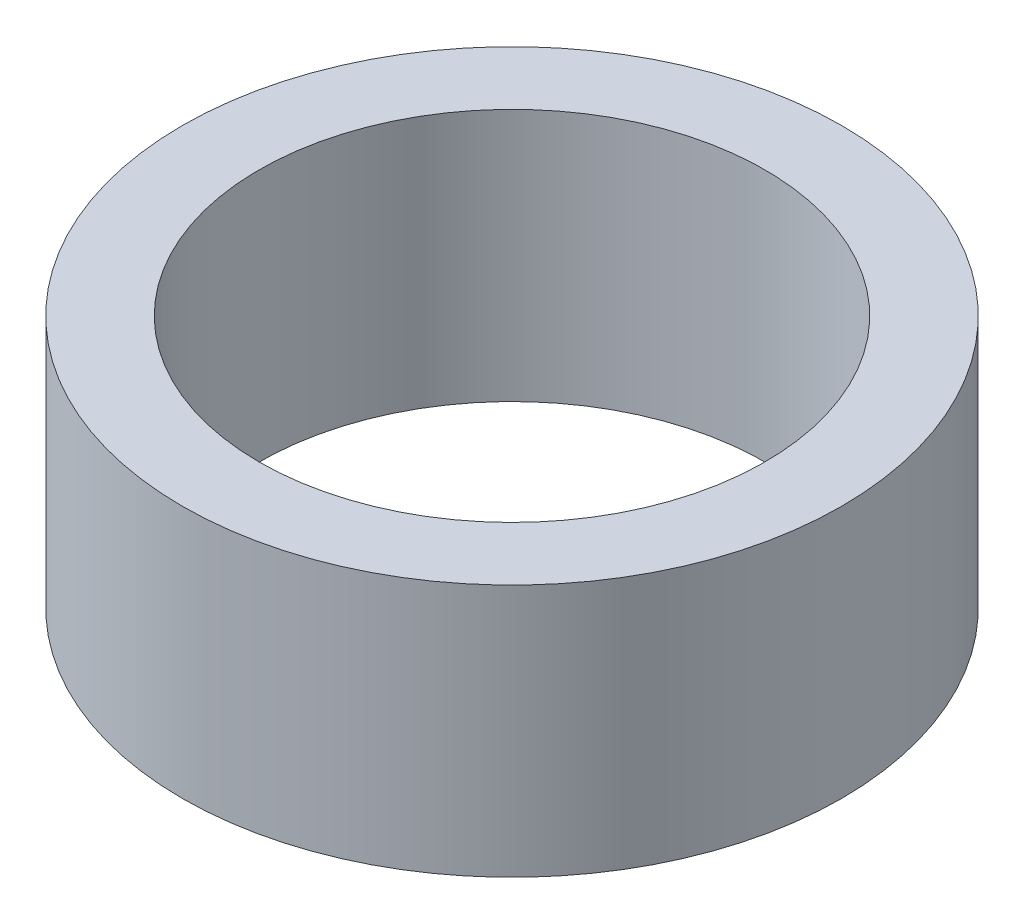
ISO-10303-21;
HEADER;
FILE_DESCRIPTION(('STEP AP214'),'2;1');
FILE_NAME('part.step','',(''),(''),'','','');
FILE_SCHEMA(('AUTOMOTIVE_DESIGN { 1 0 10303 214 1 1 1 1 }'));
ENDSEC;
DATA;
#1=APPLICATION_CONTEXT('core data for automotive mechanical design processes');
#2=APPLICATION_PROTOCOL_DEFINITION('international standard','automotive_design',2000,#1);
#3=PRODUCT_CONTEXT('',#1,'mechanical');
#4=PRODUCT('Part','Part','',(#3));
#5=PRODUCT_RELATED_PRODUCT_CATEGORY('part','',(#4));
#6=PRODUCT_DEFINITION_FORMATION('','',#4);
#7=PRODUCT_DEFINITION_CONTEXT('part definition',#1,'design');
#8=PRODUCT_DEFINITION('design','',#6,#7);
#9=PRODUCT_DEFINITION_SHAPE('','',#8);
#10=(LENGTH_UNIT() NAMED_UNIT(*) SI_UNIT(.MILLI.,.METRE.));
#11=(NAMED_UNIT(*) PLANE_ANGLE_UNIT() SI_UNIT($,.RADIAN.));
#12=(NAMED_UNIT(*) SI_UNIT($,.STERADIAN.) SOLID_ANGLE_UNIT());
#13=UNCERTAINTY_MEASURE_WITH_UNIT(LENGTH_MEASURE(1.E-05),#10,'distance_accuracy_value','');
#14=(GEOMETRIC_REPRESENTATION_CONTEXT(3) GLOBAL_UNCERTAINTY_ASSIGNED_CONTEXT((#13)) GLOBAL_UNIT_ASSIGNED_CONTEXT((#10,
#11,#12)) REPRESENTATION_CONTEXT('',''));
#15=CARTESIAN_POINT('',(0.,0.,0.));
#16=DIRECTION('',(0.,0.,1.));
#17=DIRECTION('',(1.,0.,0.));
#18=AXIS2_PLACEMENT_3D('',#15,#16,#17);
#19=CARTESIAN_POINT('',(0.,18.422,0.));
#20=DIRECTION('',(0.,1.,0.));
#21=DIRECTION('',(0.,0.,1.));
#22=AXIS2_PLACEMENT_3D('',#19,#20,#21);
#23=PLANE('',#22);
#24=CARTESIAN_POINT('',(0.,18.422,0.));
#25=DIRECTION('',(0.,1.,0.));
#26=DIRECTION('',(0.,0.,1.));
#27=AXIS2_PLACEMENT_3D('',#24,#25,#26);
#28=CIRCLE('',#27,24.);
#29=CARTESIAN_POINT('',(0.,18.422,24.));
#30=VERTEX_POINT('',#29);
#31=EDGE_CURVE('E10',#30,#30,#28,.T.);
#32=ORIENTED_EDGE('',*,*,#31,.T.);
#33=EDGE_LOOP('',(#32));
#34=FACE_BOUND('',#33,.T.);
#35=CARTESIAN_POINT('',(0.,18.422,0.));
#36=DIRECTION('',(0.,1.,0.));
#37=DIRECTION('',(0.,0.,1.));
#38=AXIS2_PLACEMENT_3D('',#35,#36,#37);
#39=CIRCLE('',#38,18.415);
#40=CARTESIAN_POINT('',(0.,18.422,18.415));
#41=VERTEX_POINT('',#40);
#42=EDGE_CURVE('E42',#41,#41,#39,.T.);
#43=ORIENTED_EDGE('',*,*,#42,.F.);
#44=EDGE_LOOP('',(#43));
#45=FACE_BOUND('',#44,.T.);
#46=ADVANCED_FACE('F31',(#34,#45),#23,.T.);
#47=CARTESIAN_POINT('',(0.,0.,0.));
#48=DIRECTION('',(0.,1.,0.));
#49=DIRECTION('',(0.,0.,1.));
#50=AXIS2_PLACEMENT_3D('',#47,#48,#49);
#51=PLANE('',#50);
#52=CARTESIAN_POINT('',(0.,0.,0.));
#53=DIRECTION('',(0.,1.,0.));
#54=DIRECTION('',(0.,0.,1.));
#55=AXIS2_PLACEMENT_3D('',#52,#53,#54);
#56=CIRCLE('',#55,24.);
#57=CARTESIAN_POINT('',(0.,0.,24.));
#58=VERTEX_POINT('',#57);
#59=EDGE_CURVE('E35',#58,#58,#56,.T.);
#60=ORIENTED_EDGE('',*,*,#59,.F.);
#61=EDGE_LOOP('',(#60));
#62=FACE_BOUND('',#61,.T.);
#63=CARTESIAN_POINT('',(0.,0.,0.));
#64=DIRECTION('',(0.,1.,0.));
#65=DIRECTION('',(0.,0.,1.));
#66=AXIS2_PLACEMENT_3D('',#63,#64,#65);
#67=CIRCLE('',#66,18.415);
#68=CARTESIAN_POINT('',(0.,0.,18.415));
#69=VERTEX_POINT('',#68);
#70=EDGE_CURVE('E44',#69,#69,#67,.T.);
#71=ORIENTED_EDGE('',*,*,#70,.T.);
#72=EDGE_LOOP('',(#71));
#73=FACE_BOUND('',#72,.T.);
#74=ADVANCED_FACE('F54',(#62,#73),#51,.F.);
#75=CARTESIAN_POINT('',(0.,18.422,0.));
#76=DIRECTION('',(0.,-1.,0.));
#77=DIRECTION('',(0.,0.,-1.));
#78=AXIS2_PLACEMENT_3D('',#75,#76,#77);
#79=CYLINDRICAL_SURFACE('',#78,24.);
#80=ORIENTED_EDGE('',*,*,#31,.F.);
#81=EDGE_LOOP('',(#80));
#82=FACE_BOUND('',#81,.T.);
#83=ORIENTED_EDGE('',*,*,#59,.T.);
#84=EDGE_LOOP('',(#83));
#85=FACE_BOUND('',#84,.T.);
#86=ADVANCED_FACE('F33',(#82,#85),#79,.T.);
#87=CARTESIAN_POINT('',(0.,18.422,0.));
#88=DIRECTION('',(0.,-1.,0.));
#89=DIRECTION('',(0.,0.,-1.));
#90=AXIS2_PLACEMENT_3D('',#87,#88,#89);
#91=CYLINDRICAL_SURFACE('',#90,18.415);
#92=ORIENTED_EDGE('',*,*,#42,.T.);
#93=EDGE_LOOP('',(#92));
#94=FACE_BOUND('',#93,.T.);
#95=ORIENTED_EDGE('',*,*,#70,.F.);
#96=EDGE_LOOP('',(#95));
#97=FACE_BOUND('',#96,.T.);
#98=ADVANCED_FACE('F50',(#94,#97),#91,.F.);
#99=CLOSED_SHELL('',(#46,#74,#86,#98));
#100=MANIFOLD_SOLID_BREP('B2',#99);
#101=ADVANCED_BREP_SHAPE_REPRESENTATION('',(#18,#100),#14);
#102=SHAPE_DEFINITION_REPRESENTATION(#9,#101);
ENDSEC;
END-ISO-10303-21;
